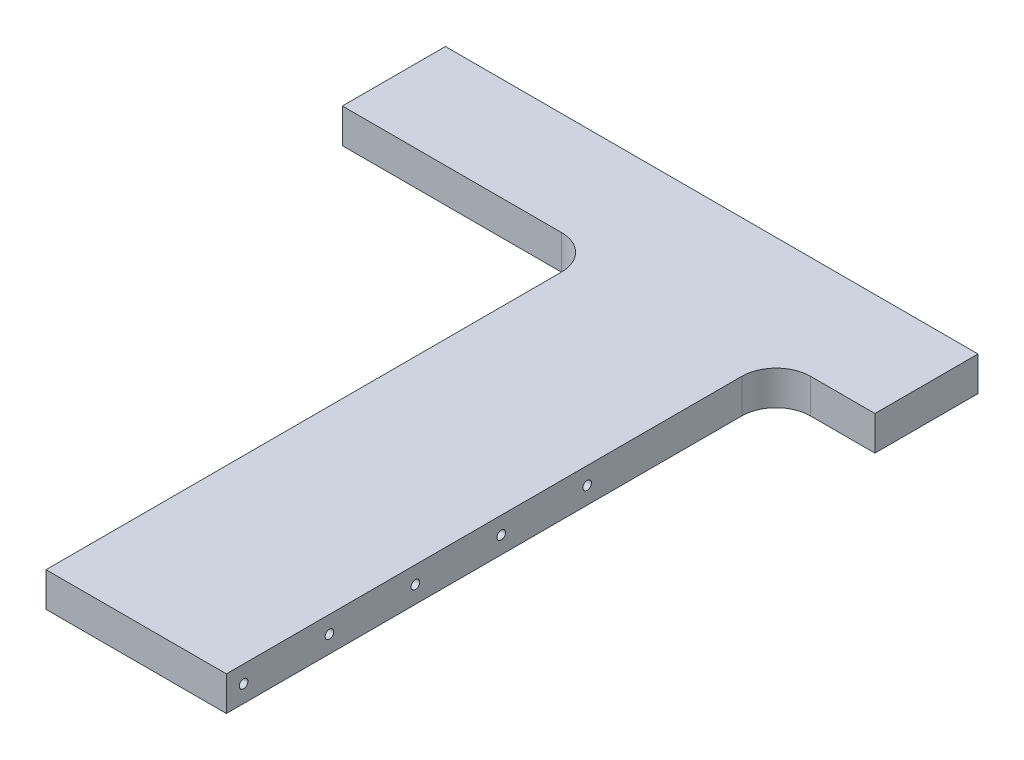
ISO-10303-21;
HEADER;
FILE_DESCRIPTION(('STEP AP214'),'2;1');
FILE_NAME('part.step','',(''),(''),'','','');
FILE_SCHEMA(('AUTOMOTIVE_DESIGN { 1 0 10303 214 1 1 1 1 }'));
ENDSEC;
DATA;
#1=APPLICATION_CONTEXT('core data for automotive mechanical design processes');
#2=APPLICATION_PROTOCOL_DEFINITION('international standard','automotive_design',2000,#1);
#3=PRODUCT_CONTEXT('',#1,'mechanical');
#4=PRODUCT('Part','Part','',(#3));
#5=PRODUCT_RELATED_PRODUCT_CATEGORY('part','',(#4));
#6=PRODUCT_DEFINITION_FORMATION('','',#4);
#7=PRODUCT_DEFINITION_CONTEXT('part definition',#1,'design');
#8=PRODUCT_DEFINITION('design','',#6,#7);
#9=PRODUCT_DEFINITION_SHAPE('','',#8);
#10=(LENGTH_UNIT() NAMED_UNIT(*) SI_UNIT(.MILLI.,.METRE.));
#11=(NAMED_UNIT(*) PLANE_ANGLE_UNIT() SI_UNIT($,.RADIAN.));
#12=(NAMED_UNIT(*) SI_UNIT($,.STERADIAN.) SOLID_ANGLE_UNIT());
#13=UNCERTAINTY_MEASURE_WITH_UNIT(LENGTH_MEASURE(1.E-05),#10,'distance_accuracy_value','');
#14=(GEOMETRIC_REPRESENTATION_CONTEXT(3) GLOBAL_UNCERTAINTY_ASSIGNED_CONTEXT((#13)) GLOBAL_UNIT_ASSIGNED_CONTEXT((#10,
#11,#12)) REPRESENTATION_CONTEXT('',''));
#15=CARTESIAN_POINT('',(0.,0.,0.));
#16=DIRECTION('',(0.,0.,1.));
#17=DIRECTION('',(1.,0.,0.));
#18=AXIS2_PLACEMENT_3D('',#15,#16,#17);
#19=CARTESIAN_POINT('',(-52.5,20.,0.));
#20=DIRECTION('',(1.,0.,0.));
#21=DIRECTION('',(0.,0.,-1.));
#22=AXIS2_PLACEMENT_3D('',#19,#20,#21);
#23=PLANE('',#22);
#24=CARTESIAN_POINT('',(-52.5,10.,-9.99999999999997));
#25=DIRECTION('',(-1.,0.,0.));
#26=DIRECTION('',(0.,0.,1.));
#27=AXIS2_PLACEMENT_3D('',#24,#25,#26);
#28=CIRCLE('',#27,2.5);
#29=CARTESIAN_POINT('',(-52.5,10.,-7.49999999999997));
#30=VERTEX_POINT('',#29);
#31=EDGE_CURVE('E198',#30,#30,#28,.T.);
#32=ORIENTED_EDGE('',*,*,#31,.F.);
#33=EDGE_LOOP('',(#32));
#34=FACE_BOUND('',#33,.T.);
#35=CARTESIAN_POINT('',(-52.5,10.,-60.));
#36=DIRECTION('',(-1.,0.,0.));
#37=DIRECTION('',(0.,0.,1.));
#38=AXIS2_PLACEMENT_3D('',#35,#36,#37);
#39=CIRCLE('',#38,2.5);
#40=CARTESIAN_POINT('',(-52.5,10.,-57.5));
#41=VERTEX_POINT('',#40);
#42=EDGE_CURVE('E204',#41,#41,#39,.T.);
#43=ORIENTED_EDGE('',*,*,#42,.F.);
#44=EDGE_LOOP('',(#43));
#45=FACE_BOUND('',#44,.T.);
#46=CARTESIAN_POINT('',(-52.5,10.,-110.));
#47=DIRECTION('',(-1.,0.,0.));
#48=DIRECTION('',(0.,0.,1.));
#49=AXIS2_PLACEMENT_3D('',#46,#47,#48);
#50=CIRCLE('',#49,2.5);
#51=CARTESIAN_POINT('',(-52.5,10.,-107.5));
#52=VERTEX_POINT('',#51);
#53=EDGE_CURVE('E210',#52,#52,#50,.T.);
#54=ORIENTED_EDGE('',*,*,#53,.F.);
#55=EDGE_LOOP('',(#54));
#56=FACE_BOUND('',#55,.T.);
#57=CARTESIAN_POINT('',(-52.5,10.,-160.));
#58=DIRECTION('',(-1.,0.,0.));
#59=DIRECTION('',(0.,0.,1.));
#60=AXIS2_PLACEMENT_3D('',#57,#58,#59);
#61=CIRCLE('',#60,2.5);
#62=CARTESIAN_POINT('',(-52.5,10.,-157.5));
#63=VERTEX_POINT('',#62);
#64=EDGE_CURVE('E216',#63,#63,#61,.T.);
#65=ORIENTED_EDGE('',*,*,#64,.F.);
#66=EDGE_LOOP('',(#65));
#67=FACE_BOUND('',#66,.T.);
#68=CARTESIAN_POINT('',(-52.5,10.,-210.));
#69=DIRECTION('',(-1.,0.,0.));
#70=DIRECTION('',(0.,0.,1.));
#71=AXIS2_PLACEMENT_3D('',#68,#69,#70);
#72=CIRCLE('',#71,2.5);
#73=CARTESIAN_POINT('',(-52.5,10.,-207.5));
#74=VERTEX_POINT('',#73);
#75=EDGE_CURVE('E222',#74,#74,#72,.T.);
#76=ORIENTED_EDGE('',*,*,#75,.F.);
#77=EDGE_LOOP('',(#76));
#78=FACE_BOUND('',#77,.T.);
#79=DIRECTION('',(0.,0.,1.));
#80=VECTOR('',#79,1.);
#81=CARTESIAN_POINT('',(-52.5,20.,0.));
#82=LINE('',#81,#80);
#83=CARTESIAN_POINT('',(-52.5,20.,-300.));
#84=VERTEX_POINT('',#83);
#85=CARTESIAN_POINT('',(-52.5,20.,0.));
#86=VERTEX_POINT('',#85);
#87=EDGE_CURVE('E259',#84,#86,#82,.T.);
#88=ORIENTED_EDGE('',*,*,#87,.F.);
#89=DIRECTION('',(0.,-1.,0.));
#90=VECTOR('',#89,1.);
#91=CARTESIAN_POINT('',(-52.5,0.,-300.));
#92=LINE('',#91,#90);
#93=CARTESIAN_POINT('',(-52.5,0.,-300.));
#94=VERTEX_POINT('',#93);
#95=EDGE_CURVE('E315',#84,#94,#92,.T.);
#96=ORIENTED_EDGE('',*,*,#95,.T.);
#97=DIRECTION('',(0.,0.,1.));
#98=VECTOR('',#97,1.);
#99=CARTESIAN_POINT('',(-52.5,0.,0.));
#100=LINE('',#99,#98);
#101=CARTESIAN_POINT('',(-52.5,0.,0.));
#102=VERTEX_POINT('',#101);
#103=EDGE_CURVE('E258',#94,#102,#100,.T.);
#104=ORIENTED_EDGE('',*,*,#103,.T.);
#105=DIRECTION('',(0.,-1.,0.));
#106=VECTOR('',#105,1.);
#107=CARTESIAN_POINT('',(-52.5,20.,0.));
#108=LINE('',#107,#106);
#109=EDGE_CURVE('E307',#86,#102,#108,.T.);
#110=ORIENTED_EDGE('',*,*,#109,.F.);
#111=EDGE_LOOP('',(#88,#96,#104,#110));
#112=FACE_BOUND('',#111,.T.);
#113=ADVANCED_FACE('F39',(#34,#45,#56,#67,#78,#112),#23,.F.);
#114=CARTESIAN_POINT('',(-52.5,20.,0.));
#115=DIRECTION('',(0.,0.,-1.));
#116=DIRECTION('',(-1.,0.,0.));
#117=AXIS2_PLACEMENT_3D('',#114,#115,#116);
#118=PLANE('',#117);
#119=DIRECTION('',(1.,0.,0.));
#120=VECTOR('',#119,1.);
#121=CARTESIAN_POINT('',(-52.5,0.,0.));
#122=LINE('',#121,#120);
#123=CARTESIAN_POINT('',(52.5,0.,0.));
#124=VERTEX_POINT('',#123);
#125=EDGE_CURVE('E279',#102,#124,#122,.T.);
#126=ORIENTED_EDGE('',*,*,#125,.T.);
#127=DIRECTION('',(0.,-1.,0.));
#128=VECTOR('',#127,1.);
#129=CARTESIAN_POINT('',(52.5,20.,0.));
#130=LINE('',#129,#128);
#131=CARTESIAN_POINT('',(52.5,20.,0.));
#132=VERTEX_POINT('',#131);
#133=EDGE_CURVE('E304',#132,#124,#130,.T.);
#134=ORIENTED_EDGE('',*,*,#133,.F.);
#135=DIRECTION('',(1.,0.,0.));
#136=VECTOR('',#135,1.);
#137=CARTESIAN_POINT('',(-52.5,20.,0.));
#138=LINE('',#137,#136);
#139=EDGE_CURVE('E261',#86,#132,#138,.T.);
#140=ORIENTED_EDGE('',*,*,#139,.F.);
#141=ORIENTED_EDGE('',*,*,#109,.T.);
#142=EDGE_LOOP('',(#126,#134,#140,#141));
#143=FACE_BOUND('',#142,.T.);
#144=ADVANCED_FACE('F345',(#143),#118,.F.);
#145=CARTESIAN_POINT('',(52.5,20.,0.));
#146=DIRECTION('',(-1.,0.,0.));
#147=DIRECTION('',(0.,0.,1.));
#148=AXIS2_PLACEMENT_3D('',#145,#146,#147);
#149=PLANE('',#148);
#150=CARTESIAN_POINT('',(52.5,10.,-9.99999999999997));
#151=DIRECTION('',(1.,0.,0.));
#152=DIRECTION('',(0.,0.,-1.));
#153=AXIS2_PLACEMENT_3D('',#150,#151,#152);
#154=CIRCLE('',#153,2.5);
#155=CARTESIAN_POINT('',(52.5,10.,-12.5));
#156=VERTEX_POINT('',#155);
#157=EDGE_CURVE('E228',#156,#156,#154,.T.);
#158=ORIENTED_EDGE('',*,*,#157,.F.);
#159=EDGE_LOOP('',(#158));
#160=FACE_BOUND('',#159,.T.);
#161=CARTESIAN_POINT('',(52.5,10.,-60.));
#162=DIRECTION('',(1.,0.,0.));
#163=DIRECTION('',(0.,0.,-1.));
#164=AXIS2_PLACEMENT_3D('',#161,#162,#163);
#165=CIRCLE('',#164,2.5);
#166=CARTESIAN_POINT('',(52.5,10.,-62.5));
#167=VERTEX_POINT('',#166);
#168=EDGE_CURVE('E234',#167,#167,#165,.T.);
#169=ORIENTED_EDGE('',*,*,#168,.F.);
#170=EDGE_LOOP('',(#169));
#171=FACE_BOUND('',#170,.T.);
#172=CARTESIAN_POINT('',(52.5,10.,-110.));
#173=DIRECTION('',(1.,0.,0.));
#174=DIRECTION('',(0.,0.,-1.));
#175=AXIS2_PLACEMENT_3D('',#172,#173,#174);
#176=CIRCLE('',#175,2.5);
#177=CARTESIAN_POINT('',(52.5,10.,-112.5));
#178=VERTEX_POINT('',#177);
#179=EDGE_CURVE('E240',#178,#178,#176,.T.);
#180=ORIENTED_EDGE('',*,*,#179,.F.);
#181=EDGE_LOOP('',(#180));
#182=FACE_BOUND('',#181,.T.);
#183=CARTESIAN_POINT('',(52.5,10.,-160.));
#184=DIRECTION('',(1.,0.,0.));
#185=DIRECTION('',(0.,0.,-1.));
#186=AXIS2_PLACEMENT_3D('',#183,#184,#185);
#187=CIRCLE('',#186,2.5);
#188=CARTESIAN_POINT('',(52.5,10.,-162.5));
#189=VERTEX_POINT('',#188);
#190=EDGE_CURVE('E246',#189,#189,#187,.T.);
#191=ORIENTED_EDGE('',*,*,#190,.F.);
#192=EDGE_LOOP('',(#191));
#193=FACE_BOUND('',#192,.T.);
#194=CARTESIAN_POINT('',(52.5,10.,-210.));
#195=DIRECTION('',(1.,0.,0.));
#196=DIRECTION('',(0.,0.,-1.));
#197=AXIS2_PLACEMENT_3D('',#194,#195,#196);
#198=CIRCLE('',#197,2.5);
#199=CARTESIAN_POINT('',(52.5,10.,-212.5));
#200=VERTEX_POINT('',#199);
#201=EDGE_CURVE('E252',#200,#200,#198,.T.);
#202=ORIENTED_EDGE('',*,*,#201,.F.);
#203=EDGE_LOOP('',(#202));
#204=FACE_BOUND('',#203,.T.);
#205=DIRECTION('',(0.,0.,-1.));
#206=VECTOR('',#205,1.);
#207=CARTESIAN_POINT('',(52.5,0.,0.));
#208=LINE('',#207,#206);
#209=CARTESIAN_POINT('',(52.4999999999999,0.,-300.));
#210=VERTEX_POINT('',#209);
#211=EDGE_CURVE('E281',#124,#210,#208,.T.);
#212=ORIENTED_EDGE('',*,*,#211,.T.);
#213=DIRECTION('',(0.,-1.,0.));
#214=VECTOR('',#213,1.);
#215=CARTESIAN_POINT('',(52.4999999999999,20.,-300.));
#216=LINE('',#215,#214);
#217=CARTESIAN_POINT('',(52.4999999999999,20.,-300.));
#218=VERTEX_POINT('',#217);
#219=EDGE_CURVE('E313',#210,#218,#216,.F.);
#220=ORIENTED_EDGE('',*,*,#219,.T.);
#221=DIRECTION('',(0.,0.,-1.));
#222=VECTOR('',#221,1.);
#223=CARTESIAN_POINT('',(52.5,20.,0.));
#224=LINE('',#223,#222);
#225=EDGE_CURVE('E264',#132,#218,#224,.T.);
#226=ORIENTED_EDGE('',*,*,#225,.F.);
#227=ORIENTED_EDGE('',*,*,#133,.T.);
#228=EDGE_LOOP('',(#212,#220,#226,#227));
#229=FACE_BOUND('',#228,.T.);
#230=ADVANCED_FACE('F341',(#160,#171,#182,#193,#204,#229),#149,.F.);
#231=CARTESIAN_POINT('',(110.,20.,-320.));
#232=DIRECTION('',(0.,0.,-1.));
#233=DIRECTION('',(-1.,0.,0.));
#234=AXIS2_PLACEMENT_3D('',#231,#232,#233);
#235=PLANE('',#234);
#236=DIRECTION('',(1.,0.,0.));
#237=VECTOR('',#236,1.);
#238=CARTESIAN_POINT('',(110.,20.,-320.));
#239=LINE('',#238,#237);
#240=CARTESIAN_POINT('',(72.4999999999999,20.,-320.));
#241=VERTEX_POINT('',#240);
#242=CARTESIAN_POINT('',(110.,20.,-320.));
#243=VERTEX_POINT('',#242);
#244=EDGE_CURVE('E267',#241,#243,#239,.T.);
#245=ORIENTED_EDGE('',*,*,#244,.F.);
#246=DIRECTION('',(0.,-1.,0.));
#247=VECTOR('',#246,1.);
#248=CARTESIAN_POINT('',(72.4999999999999,0.,-320.));
#249=LINE('',#248,#247);
#250=CARTESIAN_POINT('',(72.4999999999999,0.,-320.));
#251=VERTEX_POINT('',#250);
#252=EDGE_CURVE('E310',#241,#251,#249,.T.);
#253=ORIENTED_EDGE('',*,*,#252,.T.);
#254=DIRECTION('',(1.,0.,0.));
#255=VECTOR('',#254,1.);
#256=CARTESIAN_POINT('',(110.,0.,-320.));
#257=LINE('',#256,#255);
#258=CARTESIAN_POINT('',(110.,0.,-320.));
#259=VERTEX_POINT('',#258);
#260=EDGE_CURVE('E284',#251,#259,#257,.T.);
#261=ORIENTED_EDGE('',*,*,#260,.T.);
#262=DIRECTION('',(0.,-1.,0.));
#263=VECTOR('',#262,1.);
#264=CARTESIAN_POINT('',(110.,20.,-320.));
#265=LINE('',#264,#263);
#266=EDGE_CURVE('E301',#243,#259,#265,.T.);
#267=ORIENTED_EDGE('',*,*,#266,.F.);
#268=EDGE_LOOP('',(#245,#253,#261,#267));
#269=FACE_BOUND('',#268,.T.);
#270=ADVANCED_FACE('F332',(#269),#235,.F.);
#271=CARTESIAN_POINT('',(110.,20.,-380.));
#272=DIRECTION('',(-1.,0.,0.));
#273=DIRECTION('',(0.,0.,1.));
#274=AXIS2_PLACEMENT_3D('',#271,#272,#273);
#275=PLANE('',#274);
#276=DIRECTION('',(0.,0.,-1.));
#277=VECTOR('',#276,1.);
#278=CARTESIAN_POINT('',(110.,0.,-380.));
#279=LINE('',#278,#277);
#280=CARTESIAN_POINT('',(110.,0.,-380.));
#281=VERTEX_POINT('',#280);
#282=EDGE_CURVE('E286',#259,#281,#279,.T.);
#283=ORIENTED_EDGE('',*,*,#282,.T.);
#284=DIRECTION('',(0.,-1.,0.));
#285=VECTOR('',#284,1.);
#286=CARTESIAN_POINT('',(110.,20.,-380.));
#287=LINE('',#286,#285);
#288=CARTESIAN_POINT('',(110.,20.,-380.));
#289=VERTEX_POINT('',#288);
#290=EDGE_CURVE('E298',#289,#281,#287,.T.);
#291=ORIENTED_EDGE('',*,*,#290,.F.);
#292=DIRECTION('',(0.,0.,-1.));
#293=VECTOR('',#292,1.);
#294=CARTESIAN_POINT('',(110.,20.,-380.));
#295=LINE('',#294,#293);
#296=EDGE_CURVE('E269',#243,#289,#295,.T.);
#297=ORIENTED_EDGE('',*,*,#296,.F.);
#298=ORIENTED_EDGE('',*,*,#266,.T.);
#299=EDGE_LOOP('',(#283,#291,#297,#298));
#300=FACE_BOUND('',#299,.T.);
#301=ADVANCED_FACE('F365',(#300),#275,.F.);
#302=CARTESIAN_POINT('',(-200.,20.,-380.));
#303=DIRECTION('',(0.,0.,1.));
#304=DIRECTION('',(1.,0.,0.));
#305=AXIS2_PLACEMENT_3D('',#302,#303,#304);
#306=PLANE('',#305);
#307=CARTESIAN_POINT('',(29.9999999999999,10.,-380.));
#308=DIRECTION('',(0.,0.,-1.));
#309=DIRECTION('',(-1.,0.,0.));
#310=AXIS2_PLACEMENT_3D('',#307,#308,#309);
#311=CIRCLE('',#310,3.);
#312=CARTESIAN_POINT('',(26.9999999999999,10.,-380.));
#313=VERTEX_POINT('',#312);
#314=EDGE_CURVE('E170',#313,#313,#311,.T.);
#315=ORIENTED_EDGE('',*,*,#314,.F.);
#316=EDGE_LOOP('',(#315));
#317=FACE_BOUND('',#316,.T.);
#318=CARTESIAN_POINT('',(-120.,10.,-380.));
#319=DIRECTION('',(0.,0.,-1.));
#320=DIRECTION('',(-1.,0.,0.));
#321=AXIS2_PLACEMENT_3D('',#318,#319,#320);
#322=CIRCLE('',#321,3.);
#323=CARTESIAN_POINT('',(-123.,10.,-380.));
#324=VERTEX_POINT('',#323);
#325=EDGE_CURVE('E169',#324,#324,#322,.T.);
#326=ORIENTED_EDGE('',*,*,#325,.F.);
#327=EDGE_LOOP('',(#326));
#328=FACE_BOUND('',#327,.T.);
#329=CARTESIAN_POINT('',(89.9999999999999,10.,-380.));
#330=DIRECTION('',(0.,0.,-1.));
#331=DIRECTION('',(-1.,0.,0.));
#332=AXIS2_PLACEMENT_3D('',#329,#330,#331);
#333=CIRCLE('',#332,2.49999999999999);
#334=CARTESIAN_POINT('',(87.4999999999999,10.,-380.));
#335=VERTEX_POINT('',#334);
#336=EDGE_CURVE('E180',#335,#335,#333,.T.);
#337=ORIENTED_EDGE('',*,*,#336,.F.);
#338=EDGE_LOOP('',(#337));
#339=FACE_BOUND('',#338,.T.);
#340=CARTESIAN_POINT('',(-180.,10.,-380.));
#341=DIRECTION('',(0.,0.,-1.));
#342=DIRECTION('',(-1.,0.,0.));
#343=AXIS2_PLACEMENT_3D('',#340,#341,#342);
#344=CIRCLE('',#343,2.5);
#345=CARTESIAN_POINT('',(-182.5,10.,-380.));
#346=VERTEX_POINT('',#345);
#347=EDGE_CURVE('E186',#346,#346,#344,.T.);
#348=ORIENTED_EDGE('',*,*,#347,.F.);
#349=EDGE_LOOP('',(#348));
#350=FACE_BOUND('',#349,.T.);
#351=CARTESIAN_POINT('',(0.,10.,-380.));
#352=DIRECTION('',(0.,0.,-1.));
#353=DIRECTION('',(-1.,0.,0.));
#354=AXIS2_PLACEMENT_3D('',#351,#352,#353);
#355=CIRCLE('',#354,2.49999999999999);
#356=CARTESIAN_POINT('',(-2.49999999999999,10.,-380.));
#357=VERTEX_POINT('',#356);
#358=EDGE_CURVE('E192',#357,#357,#355,.T.);
#359=ORIENTED_EDGE('',*,*,#358,.F.);
#360=EDGE_LOOP('',(#359));
#361=FACE_BOUND('',#360,.T.);
#362=DIRECTION('',(-1.,0.,0.));
#363=VECTOR('',#362,1.);
#364=CARTESIAN_POINT('',(-200.,0.,-380.));
#365=LINE('',#364,#363);
#366=CARTESIAN_POINT('',(-200.,0.,-380.));
#367=VERTEX_POINT('',#366);
#368=EDGE_CURVE('E288',#281,#367,#365,.T.);
#369=ORIENTED_EDGE('',*,*,#368,.T.);
#370=DIRECTION('',(0.,-1.,0.));
#371=VECTOR('',#370,1.);
#372=CARTESIAN_POINT('',(-200.,20.,-380.));
#373=LINE('',#372,#371);
#374=CARTESIAN_POINT('',(-200.,20.,-380.));
#375=VERTEX_POINT('',#374);
#376=EDGE_CURVE('E295',#375,#367,#373,.T.);
#377=ORIENTED_EDGE('',*,*,#376,.F.);
#378=DIRECTION('',(-1.,0.,0.));
#379=VECTOR('',#378,1.);
#380=CARTESIAN_POINT('',(-200.,20.,-380.));
#381=LINE('',#380,#379);
#382=EDGE_CURVE('E271',#289,#375,#381,.T.);
#383=ORIENTED_EDGE('',*,*,#382,.F.);
#384=ORIENTED_EDGE('',*,*,#290,.T.);
#385=EDGE_LOOP('',(#369,#377,#383,#384));
#386=FACE_BOUND('',#385,.T.);
#387=ADVANCED_FACE('F362',(#317,#328,#339,#350,#361,#386),#306,.F.);
#388=CARTESIAN_POINT('',(-200.,20.,-380.));
#389=DIRECTION('',(1.,0.,0.));
#390=DIRECTION('',(0.,0.,-1.));
#391=AXIS2_PLACEMENT_3D('',#388,#389,#390);
#392=PLANE('',#391);
#393=DIRECTION('',(0.,0.,1.));
#394=VECTOR('',#393,1.);
#395=CARTESIAN_POINT('',(-200.,0.,-380.));
#396=LINE('',#395,#394);
#397=CARTESIAN_POINT('',(-200.,0.,-320.));
#398=VERTEX_POINT('',#397);
#399=EDGE_CURVE('E290',#367,#398,#396,.T.);
#400=ORIENTED_EDGE('',*,*,#399,.T.);
#401=DIRECTION('',(0.,-1.,0.));
#402=VECTOR('',#401,1.);
#403=CARTESIAN_POINT('',(-200.,20.,-320.));
#404=LINE('',#403,#402);
#405=CARTESIAN_POINT('',(-200.,20.,-320.));
#406=VERTEX_POINT('',#405);
#407=EDGE_CURVE('E277',#406,#398,#404,.T.);
#408=ORIENTED_EDGE('',*,*,#407,.F.);
#409=DIRECTION('',(0.,0.,1.));
#410=VECTOR('',#409,1.);
#411=CARTESIAN_POINT('',(-200.,20.,-380.));
#412=LINE('',#411,#410);
#413=EDGE_CURVE('E273',#375,#406,#412,.T.);
#414=ORIENTED_EDGE('',*,*,#413,.F.);
#415=ORIENTED_EDGE('',*,*,#376,.T.);
#416=EDGE_LOOP('',(#400,#408,#414,#415));
#417=FACE_BOUND('',#416,.T.);
#418=ADVANCED_FACE('F358',(#417),#392,.F.);
#419=CARTESIAN_POINT('',(-200.,20.,-320.));
#420=DIRECTION('',(0.,0.,-1.));
#421=DIRECTION('',(-1.,0.,0.));
#422=AXIS2_PLACEMENT_3D('',#419,#420,#421);
#423=PLANE('',#422);
#424=DIRECTION('',(1.,0.,0.));
#425=VECTOR('',#424,1.);
#426=CARTESIAN_POINT('',(-200.,0.,-320.));
#427=LINE('',#426,#425);
#428=CARTESIAN_POINT('',(-72.5000000000001,0.,-320.));
#429=VERTEX_POINT('',#428);
#430=EDGE_CURVE('E262',#398,#429,#427,.T.);
#431=ORIENTED_EDGE('',*,*,#430,.T.);
#432=DIRECTION('',(0.,-1.,0.));
#433=VECTOR('',#432,1.);
#434=CARTESIAN_POINT('',(-72.5,20.,-320.));
#435=LINE('',#434,#433);
#436=CARTESIAN_POINT('',(-72.5000000000001,20.,-320.));
#437=VERTEX_POINT('',#436);
#438=EDGE_CURVE('E54',#429,#437,#435,.F.);
#439=ORIENTED_EDGE('',*,*,#438,.T.);
#440=DIRECTION('',(1.,0.,0.));
#441=VECTOR('',#440,1.);
#442=CARTESIAN_POINT('',(-200.,20.,-320.));
#443=LINE('',#442,#441);
#444=EDGE_CURVE('E275',#406,#437,#443,.T.);
#445=ORIENTED_EDGE('',*,*,#444,.F.);
#446=ORIENTED_EDGE('',*,*,#407,.T.);
#447=EDGE_LOOP('',(#431,#439,#445,#446));
#448=FACE_BOUND('',#447,.T.);
#449=ADVANCED_FACE('F354',(#448),#423,.F.);
#450=CARTESIAN_POINT('',(0.,20.,0.));
#451=DIRECTION('',(0.,-1.,0.));
#452=DIRECTION('',(0.,0.,-1.));
#453=AXIS2_PLACEMENT_3D('',#450,#451,#452);
#454=PLANE('',#453);
#455=ORIENTED_EDGE('',*,*,#444,.T.);
#456=CARTESIAN_POINT('',(-72.5,20.,-300.));
#457=DIRECTION('',(0.,-1.,0.));
#458=DIRECTION('',(0.,0.,-1.));
#459=AXIS2_PLACEMENT_3D('',#456,#457,#458);
#460=CIRCLE('',#459,20.);
#461=EDGE_CURVE('E11',#437,#84,#460,.T.);
#462=ORIENTED_EDGE('',*,*,#461,.T.);
#463=ORIENTED_EDGE('',*,*,#87,.T.);
#464=ORIENTED_EDGE('',*,*,#139,.T.);
#465=ORIENTED_EDGE('',*,*,#225,.T.);
#466=CARTESIAN_POINT('',(72.4999999999999,20.,-300.));
#467=DIRECTION('',(0.,-1.,0.));
#468=DIRECTION('',(0.,0.,-1.));
#469=AXIS2_PLACEMENT_3D('',#466,#467,#468);
#470=CIRCLE('',#469,20.);
#471=EDGE_CURVE('E321',#218,#241,#470,.T.);
#472=ORIENTED_EDGE('',*,*,#471,.T.);
#473=ORIENTED_EDGE('',*,*,#244,.T.);
#474=ORIENTED_EDGE('',*,*,#296,.T.);
#475=ORIENTED_EDGE('',*,*,#382,.T.);
#476=ORIENTED_EDGE('',*,*,#413,.T.);
#477=EDGE_LOOP('',(#455,#462,#463,#464,#465,#472,#473,#474,#475,#476));
#478=FACE_BOUND('',#477,.T.);
#479=ADVANCED_FACE('F325',(#478),#454,.F.);
#480=CARTESIAN_POINT('',(0.,0.,0.));
#481=DIRECTION('',(0.,-1.,0.));
#482=DIRECTION('',(0.,0.,-1.));
#483=AXIS2_PLACEMENT_3D('',#480,#481,#482);
#484=PLANE('',#483);
#485=ORIENTED_EDGE('',*,*,#103,.F.);
#486=CARTESIAN_POINT('',(-72.5,0.,-300.));
#487=DIRECTION('',(0.,-1.,0.));
#488=DIRECTION('',(0.,0.,-1.));
#489=AXIS2_PLACEMENT_3D('',#486,#487,#488);
#490=CIRCLE('',#489,20.);
#491=EDGE_CURVE('E47',#94,#429,#490,.F.);
#492=ORIENTED_EDGE('',*,*,#491,.T.);
#493=ORIENTED_EDGE('',*,*,#430,.F.);
#494=ORIENTED_EDGE('',*,*,#399,.F.);
#495=ORIENTED_EDGE('',*,*,#368,.F.);
#496=ORIENTED_EDGE('',*,*,#282,.F.);
#497=ORIENTED_EDGE('',*,*,#260,.F.);
#498=CARTESIAN_POINT('',(72.4999999999999,0.,-300.));
#499=DIRECTION('',(0.,-1.,0.));
#500=DIRECTION('',(0.,0.,-1.));
#501=AXIS2_PLACEMENT_3D('',#498,#499,#500);
#502=CIRCLE('',#501,20.);
#503=EDGE_CURVE('E319',#251,#210,#502,.F.);
#504=ORIENTED_EDGE('',*,*,#503,.T.);
#505=ORIENTED_EDGE('',*,*,#211,.F.);
#506=ORIENTED_EDGE('',*,*,#125,.F.);
#507=EDGE_LOOP('',(#485,#492,#493,#494,#495,#496,#497,#504,#505,#506));
#508=FACE_BOUND('',#507,.T.);
#509=ADVANCED_FACE('F337',(#508),#484,.T.);
#510=CARTESIAN_POINT('',(35.5,10.,-210.));
#511=DIRECTION('',(1.,0.,0.));
#512=DIRECTION('',(0.,0.,-1.));
#513=AXIS2_PLACEMENT_3D('',#510,#511,#512);
#514=CONICAL_SURFACE('',#513,2.5,1.02974425867665);
#515=CARTESIAN_POINT('',(33.9978484524311,10.,-210.));
#516=VERTEX_POINT('',#515);
#517=VERTEX_LOOP('',#516);
#518=FACE_BOUND('',#517,.T.);
#519=CARTESIAN_POINT('',(35.5,10.,-210.));
#520=DIRECTION('',(1.,0.,0.));
#521=DIRECTION('',(0.,0.,-1.));
#522=AXIS2_PLACEMENT_3D('',#519,#520,#521);
#523=CIRCLE('',#522,2.5);
#524=CARTESIAN_POINT('',(35.5,10.,-212.5));
#525=VERTEX_POINT('',#524);
#526=EDGE_CURVE('E255',#525,#525,#523,.T.);
#527=ORIENTED_EDGE('',*,*,#526,.T.);
#528=EDGE_LOOP('',(#527));
#529=FACE_BOUND('',#528,.T.);
#530=ADVANCED_FACE('F496',(#518,#529),#514,.F.);
#531=CARTESIAN_POINT('',(52.5,10.,-210.));
#532=DIRECTION('',(1.,0.,0.));
#533=DIRECTION('',(0.,0.,-1.));
#534=AXIS2_PLACEMENT_3D('',#531,#532,#533);
#535=CYLINDRICAL_SURFACE('',#534,2.5);
#536=ORIENTED_EDGE('',*,*,#526,.F.);
#537=EDGE_LOOP('',(#536));
#538=FACE_BOUND('',#537,.T.);
#539=ORIENTED_EDGE('',*,*,#201,.T.);
#540=EDGE_LOOP('',(#539));
#541=FACE_BOUND('',#540,.T.);
#542=ADVANCED_FACE('F492',(#538,#541),#535,.F.);
#543=CARTESIAN_POINT('',(35.5,10.,-160.));
#544=DIRECTION('',(1.,0.,0.));
#545=DIRECTION('',(0.,0.,-1.));
#546=AXIS2_PLACEMENT_3D('',#543,#544,#545);
#547=CONICAL_SURFACE('',#546,2.5,1.02974425867665);
#548=CARTESIAN_POINT('',(33.9978484524311,10.,-160.));
#549=VERTEX_POINT('',#548);
#550=VERTEX_LOOP('',#549);
#551=FACE_BOUND('',#550,.T.);
#552=CARTESIAN_POINT('',(35.5,10.,-160.));
#553=DIRECTION('',(1.,0.,0.));
#554=DIRECTION('',(0.,0.,-1.));
#555=AXIS2_PLACEMENT_3D('',#552,#553,#554);
#556=CIRCLE('',#555,2.5);
#557=CARTESIAN_POINT('',(35.5,10.,-162.5));
#558=VERTEX_POINT('',#557);
#559=EDGE_CURVE('E249',#558,#558,#556,.T.);
#560=ORIENTED_EDGE('',*,*,#559,.T.);
#561=EDGE_LOOP('',(#560));
#562=FACE_BOUND('',#561,.T.);
#563=ADVANCED_FACE('F488',(#551,#562),#547,.F.);
#564=CARTESIAN_POINT('',(52.5,10.,-160.));
#565=DIRECTION('',(1.,0.,0.));
#566=DIRECTION('',(0.,0.,-1.));
#567=AXIS2_PLACEMENT_3D('',#564,#565,#566);
#568=CYLINDRICAL_SURFACE('',#567,2.5);
#569=ORIENTED_EDGE('',*,*,#559,.F.);
#570=EDGE_LOOP('',(#569));
#571=FACE_BOUND('',#570,.T.);
#572=ORIENTED_EDGE('',*,*,#190,.T.);
#573=EDGE_LOOP('',(#572));
#574=FACE_BOUND('',#573,.T.);
#575=ADVANCED_FACE('F484',(#571,#574),#568,.F.);
#576=CARTESIAN_POINT('',(35.5,10.,-110.));
#577=DIRECTION('',(1.,0.,0.));
#578=DIRECTION('',(0.,0.,-1.));
#579=AXIS2_PLACEMENT_3D('',#576,#577,#578);
#580=CONICAL_SURFACE('',#579,2.5,1.02974425867665);
#581=CARTESIAN_POINT('',(33.9978484524311,10.,-110.));
#582=VERTEX_POINT('',#581);
#583=VERTEX_LOOP('',#582);
#584=FACE_BOUND('',#583,.T.);
#585=CARTESIAN_POINT('',(35.5,10.,-110.));
#586=DIRECTION('',(1.,0.,0.));
#587=DIRECTION('',(0.,0.,-1.));
#588=AXIS2_PLACEMENT_3D('',#585,#586,#587);
#589=CIRCLE('',#588,2.5);
#590=CARTESIAN_POINT('',(35.5,10.,-112.5));
#591=VERTEX_POINT('',#590);
#592=EDGE_CURVE('E243',#591,#591,#589,.T.);
#593=ORIENTED_EDGE('',*,*,#592,.T.);
#594=EDGE_LOOP('',(#593));
#595=FACE_BOUND('',#594,.T.);
#596=ADVANCED_FACE('F480',(#584,#595),#580,.F.);
#597=CARTESIAN_POINT('',(52.5,10.,-110.));
#598=DIRECTION('',(1.,0.,0.));
#599=DIRECTION('',(0.,0.,-1.));
#600=AXIS2_PLACEMENT_3D('',#597,#598,#599);
#601=CYLINDRICAL_SURFACE('',#600,2.5);
#602=ORIENTED_EDGE('',*,*,#592,.F.);
#603=EDGE_LOOP('',(#602));
#604=FACE_BOUND('',#603,.T.);
#605=ORIENTED_EDGE('',*,*,#179,.T.);
#606=EDGE_LOOP('',(#605));
#607=FACE_BOUND('',#606,.T.);
#608=ADVANCED_FACE('F476',(#604,#607),#601,.F.);
#609=CARTESIAN_POINT('',(35.5,10.,-60.));
#610=DIRECTION('',(1.,0.,0.));
#611=DIRECTION('',(0.,0.,-1.));
#612=AXIS2_PLACEMENT_3D('',#609,#610,#611);
#613=CONICAL_SURFACE('',#612,2.5,1.02974425867665);
#614=CARTESIAN_POINT('',(33.9978484524311,10.,-60.));
#615=VERTEX_POINT('',#614);
#616=VERTEX_LOOP('',#615);
#617=FACE_BOUND('',#616,.T.);
#618=CARTESIAN_POINT('',(35.5,10.,-60.));
#619=DIRECTION('',(1.,0.,0.));
#620=DIRECTION('',(0.,0.,-1.));
#621=AXIS2_PLACEMENT_3D('',#618,#619,#620);
#622=CIRCLE('',#621,2.5);
#623=CARTESIAN_POINT('',(35.5,10.,-62.5));
#624=VERTEX_POINT('',#623);
#625=EDGE_CURVE('E237',#624,#624,#622,.T.);
#626=ORIENTED_EDGE('',*,*,#625,.T.);
#627=EDGE_LOOP('',(#626));
#628=FACE_BOUND('',#627,.T.);
#629=ADVANCED_FACE('F472',(#617,#628),#613,.F.);
#630=CARTESIAN_POINT('',(52.5,10.,-60.));
#631=DIRECTION('',(1.,0.,0.));
#632=DIRECTION('',(0.,0.,-1.));
#633=AXIS2_PLACEMENT_3D('',#630,#631,#632);
#634=CYLINDRICAL_SURFACE('',#633,2.5);
#635=ORIENTED_EDGE('',*,*,#625,.F.);
#636=EDGE_LOOP('',(#635));
#637=FACE_BOUND('',#636,.T.);
#638=ORIENTED_EDGE('',*,*,#168,.T.);
#639=EDGE_LOOP('',(#638));
#640=FACE_BOUND('',#639,.T.);
#641=ADVANCED_FACE('F468',(#637,#640),#634,.F.);
#642=CARTESIAN_POINT('',(35.5,10.,-9.99999999999997));
#643=DIRECTION('',(1.,0.,0.));
#644=DIRECTION('',(0.,0.,-1.));
#645=AXIS2_PLACEMENT_3D('',#642,#643,#644);
#646=CONICAL_SURFACE('',#645,2.5,1.02974425867665);
#647=CARTESIAN_POINT('',(33.9978484524311,10.,-9.99999999999997));
#648=VERTEX_POINT('',#647);
#649=VERTEX_LOOP('',#648);
#650=FACE_BOUND('',#649,.T.);
#651=CARTESIAN_POINT('',(35.5,10.,-9.99999999999997));
#652=DIRECTION('',(1.,0.,0.));
#653=DIRECTION('',(0.,0.,-1.));
#654=AXIS2_PLACEMENT_3D('',#651,#652,#653);
#655=CIRCLE('',#654,2.5);
#656=CARTESIAN_POINT('',(35.5,10.,-12.5));
#657=VERTEX_POINT('',#656);
#658=EDGE_CURVE('E231',#657,#657,#655,.T.);
#659=ORIENTED_EDGE('',*,*,#658,.T.);
#660=EDGE_LOOP('',(#659));
#661=FACE_BOUND('',#660,.T.);
#662=ADVANCED_FACE('F464',(#650,#661),#646,.F.);
#663=CARTESIAN_POINT('',(52.5,10.,-9.99999999999997));
#664=DIRECTION('',(1.,0.,0.));
#665=DIRECTION('',(0.,0.,-1.));
#666=AXIS2_PLACEMENT_3D('',#663,#664,#665);
#667=CYLINDRICAL_SURFACE('',#666,2.5);
#668=ORIENTED_EDGE('',*,*,#658,.F.);
#669=EDGE_LOOP('',(#668));
#670=FACE_BOUND('',#669,.T.);
#671=ORIENTED_EDGE('',*,*,#157,.T.);
#672=EDGE_LOOP('',(#671));
#673=FACE_BOUND('',#672,.T.);
#674=ADVANCED_FACE('F460',(#670,#673),#667,.F.);
#675=CARTESIAN_POINT('',(-35.5,10.,-210.));
#676=DIRECTION('',(-1.,0.,0.));
#677=DIRECTION('',(0.,0.,1.));
#678=AXIS2_PLACEMENT_3D('',#675,#676,#677);
#679=CONICAL_SURFACE('',#678,2.5,1.02974425867665);
#680=CARTESIAN_POINT('',(-33.9978484524311,10.,-210.));
#681=VERTEX_POINT('',#680);
#682=VERTEX_LOOP('',#681);
#683=FACE_BOUND('',#682,.T.);
#684=CARTESIAN_POINT('',(-35.5,10.,-210.));
#685=DIRECTION('',(-1.,0.,0.));
#686=DIRECTION('',(0.,0.,1.));
#687=AXIS2_PLACEMENT_3D('',#684,#685,#686);
#688=CIRCLE('',#687,2.5);
#689=CARTESIAN_POINT('',(-35.5,10.,-207.5));
#690=VERTEX_POINT('',#689);
#691=EDGE_CURVE('E225',#690,#690,#688,.T.);
#692=ORIENTED_EDGE('',*,*,#691,.T.);
#693=EDGE_LOOP('',(#692));
#694=FACE_BOUND('',#693,.T.);
#695=ADVANCED_FACE('F456',(#683,#694),#679,.F.);
#696=CARTESIAN_POINT('',(-52.5,10.,-210.));
#697=DIRECTION('',(-1.,0.,0.));
#698=DIRECTION('',(0.,0.,1.));
#699=AXIS2_PLACEMENT_3D('',#696,#697,#698);
#700=CYLINDRICAL_SURFACE('',#699,2.5);
#701=ORIENTED_EDGE('',*,*,#691,.F.);
#702=EDGE_LOOP('',(#701));
#703=FACE_BOUND('',#702,.T.);
#704=ORIENTED_EDGE('',*,*,#75,.T.);
#705=EDGE_LOOP('',(#704));
#706=FACE_BOUND('',#705,.T.);
#707=ADVANCED_FACE('F452',(#703,#706),#700,.F.);
#708=CARTESIAN_POINT('',(-35.5,10.,-160.));
#709=DIRECTION('',(-1.,0.,0.));
#710=DIRECTION('',(0.,0.,1.));
#711=AXIS2_PLACEMENT_3D('',#708,#709,#710);
#712=CONICAL_SURFACE('',#711,2.5,1.02974425867665);
#713=CARTESIAN_POINT('',(-33.9978484524311,10.,-160.));
#714=VERTEX_POINT('',#713);
#715=VERTEX_LOOP('',#714);
#716=FACE_BOUND('',#715,.T.);
#717=CARTESIAN_POINT('',(-35.5,10.,-160.));
#718=DIRECTION('',(-1.,0.,0.));
#719=DIRECTION('',(0.,0.,1.));
#720=AXIS2_PLACEMENT_3D('',#717,#718,#719);
#721=CIRCLE('',#720,2.5);
#722=CARTESIAN_POINT('',(-35.5,10.,-157.5));
#723=VERTEX_POINT('',#722);
#724=EDGE_CURVE('E219',#723,#723,#721,.T.);
#725=ORIENTED_EDGE('',*,*,#724,.T.);
#726=EDGE_LOOP('',(#725));
#727=FACE_BOUND('',#726,.T.);
#728=ADVANCED_FACE('F448',(#716,#727),#712,.F.);
#729=CARTESIAN_POINT('',(-52.5,10.,-160.));
#730=DIRECTION('',(-1.,0.,0.));
#731=DIRECTION('',(0.,0.,1.));
#732=AXIS2_PLACEMENT_3D('',#729,#730,#731);
#733=CYLINDRICAL_SURFACE('',#732,2.5);
#734=ORIENTED_EDGE('',*,*,#724,.F.);
#735=EDGE_LOOP('',(#734));
#736=FACE_BOUND('',#735,.T.);
#737=ORIENTED_EDGE('',*,*,#64,.T.);
#738=EDGE_LOOP('',(#737));
#739=FACE_BOUND('',#738,.T.);
#740=ADVANCED_FACE('F444',(#736,#739),#733,.F.);
#741=CARTESIAN_POINT('',(-35.5,10.,-110.));
#742=DIRECTION('',(-1.,0.,0.));
#743=DIRECTION('',(0.,0.,1.));
#744=AXIS2_PLACEMENT_3D('',#741,#742,#743);
#745=CONICAL_SURFACE('',#744,2.5,1.02974425867665);
#746=CARTESIAN_POINT('',(-33.9978484524311,10.,-110.));
#747=VERTEX_POINT('',#746);
#748=VERTEX_LOOP('',#747);
#749=FACE_BOUND('',#748,.T.);
#750=CARTESIAN_POINT('',(-35.5,10.,-110.));
#751=DIRECTION('',(-1.,0.,0.));
#752=DIRECTION('',(0.,0.,1.));
#753=AXIS2_PLACEMENT_3D('',#750,#751,#752);
#754=CIRCLE('',#753,2.5);
#755=CARTESIAN_POINT('',(-35.5,10.,-107.5));
#756=VERTEX_POINT('',#755);
#757=EDGE_CURVE('E213',#756,#756,#754,.T.);
#758=ORIENTED_EDGE('',*,*,#757,.T.);
#759=EDGE_LOOP('',(#758));
#760=FACE_BOUND('',#759,.T.);
#761=ADVANCED_FACE('F440',(#749,#760),#745,.F.);
#762=CARTESIAN_POINT('',(-52.5,10.,-110.));
#763=DIRECTION('',(-1.,0.,0.));
#764=DIRECTION('',(0.,0.,1.));
#765=AXIS2_PLACEMENT_3D('',#762,#763,#764);
#766=CYLINDRICAL_SURFACE('',#765,2.5);
#767=ORIENTED_EDGE('',*,*,#757,.F.);
#768=EDGE_LOOP('',(#767));
#769=FACE_BOUND('',#768,.T.);
#770=ORIENTED_EDGE('',*,*,#53,.T.);
#771=EDGE_LOOP('',(#770));
#772=FACE_BOUND('',#771,.T.);
#773=ADVANCED_FACE('F436',(#769,#772),#766,.F.);
#774=CARTESIAN_POINT('',(-35.5,10.,-60.));
#775=DIRECTION('',(-1.,0.,0.));
#776=DIRECTION('',(0.,0.,1.));
#777=AXIS2_PLACEMENT_3D('',#774,#775,#776);
#778=CONICAL_SURFACE('',#777,2.5,1.02974425867665);
#779=CARTESIAN_POINT('',(-33.9978484524311,10.,-60.));
#780=VERTEX_POINT('',#779);
#781=VERTEX_LOOP('',#780);
#782=FACE_BOUND('',#781,.T.);
#783=CARTESIAN_POINT('',(-35.5,10.,-60.));
#784=DIRECTION('',(-1.,0.,0.));
#785=DIRECTION('',(0.,0.,1.));
#786=AXIS2_PLACEMENT_3D('',#783,#784,#785);
#787=CIRCLE('',#786,2.5);
#788=CARTESIAN_POINT('',(-35.5,10.,-57.5));
#789=VERTEX_POINT('',#788);
#790=EDGE_CURVE('E207',#789,#789,#787,.T.);
#791=ORIENTED_EDGE('',*,*,#790,.T.);
#792=EDGE_LOOP('',(#791));
#793=FACE_BOUND('',#792,.T.);
#794=ADVANCED_FACE('F432',(#782,#793),#778,.F.);
#795=CARTESIAN_POINT('',(-52.5,10.,-60.));
#796=DIRECTION('',(-1.,0.,0.));
#797=DIRECTION('',(0.,0.,1.));
#798=AXIS2_PLACEMENT_3D('',#795,#796,#797);
#799=CYLINDRICAL_SURFACE('',#798,2.5);
#800=ORIENTED_EDGE('',*,*,#790,.F.);
#801=EDGE_LOOP('',(#800));
#802=FACE_BOUND('',#801,.T.);
#803=ORIENTED_EDGE('',*,*,#42,.T.);
#804=EDGE_LOOP('',(#803));
#805=FACE_BOUND('',#804,.T.);
#806=ADVANCED_FACE('F428',(#802,#805),#799,.F.);
#807=CARTESIAN_POINT('',(-35.5,10.,-9.99999999999997));
#808=DIRECTION('',(-1.,0.,0.));
#809=DIRECTION('',(0.,0.,1.));
#810=AXIS2_PLACEMENT_3D('',#807,#808,#809);
#811=CONICAL_SURFACE('',#810,2.5,1.02974425867665);
#812=CARTESIAN_POINT('',(-33.9978484524311,10.,-9.99999999999997));
#813=VERTEX_POINT('',#812);
#814=VERTEX_LOOP('',#813);
#815=FACE_BOUND('',#814,.T.);
#816=CARTESIAN_POINT('',(-35.5,10.,-9.99999999999997));
#817=DIRECTION('',(-1.,0.,0.));
#818=DIRECTION('',(0.,0.,1.));
#819=AXIS2_PLACEMENT_3D('',#816,#817,#818);
#820=CIRCLE('',#819,2.5);
#821=CARTESIAN_POINT('',(-35.5,10.,-7.49999999999998));
#822=VERTEX_POINT('',#821);
#823=EDGE_CURVE('E201',#822,#822,#820,.T.);
#824=ORIENTED_EDGE('',*,*,#823,.T.);
#825=EDGE_LOOP('',(#824));
#826=FACE_BOUND('',#825,.T.);
#827=ADVANCED_FACE('F424',(#815,#826),#811,.F.);
#828=CARTESIAN_POINT('',(-52.5,10.,-9.99999999999997));
#829=DIRECTION('',(-1.,0.,0.));
#830=DIRECTION('',(0.,0.,1.));
#831=AXIS2_PLACEMENT_3D('',#828,#829,#830);
#832=CYLINDRICAL_SURFACE('',#831,2.5);
#833=ORIENTED_EDGE('',*,*,#823,.F.);
#834=EDGE_LOOP('',(#833));
#835=FACE_BOUND('',#834,.T.);
#836=ORIENTED_EDGE('',*,*,#31,.T.);
#837=EDGE_LOOP('',(#836));
#838=FACE_BOUND('',#837,.T.);
#839=ADVANCED_FACE('F420',(#835,#838),#832,.F.);
#840=CARTESIAN_POINT('',(0.,10.,-363.));
#841=DIRECTION('',(0.,0.,-1.));
#842=DIRECTION('',(-1.,0.,0.));
#843=AXIS2_PLACEMENT_3D('',#840,#841,#842);
#844=CONICAL_SURFACE('',#843,2.49999999999999,1.02974425867666);
#845=CARTESIAN_POINT('',(0.,10.,-361.497848452431));
#846=VERTEX_POINT('',#845);
#847=VERTEX_LOOP('',#846);
#848=FACE_BOUND('',#847,.T.);
#849=CARTESIAN_POINT('',(0.,10.,-363.));
#850=DIRECTION('',(0.,0.,-1.));
#851=DIRECTION('',(-1.,0.,0.));
#852=AXIS2_PLACEMENT_3D('',#849,#850,#851);
#853=CIRCLE('',#852,2.49999999999999);
#854=CARTESIAN_POINT('',(-2.49999999999999,10.,-363.));
#855=VERTEX_POINT('',#854);
#856=EDGE_CURVE('E195',#855,#855,#853,.T.);
#857=ORIENTED_EDGE('',*,*,#856,.T.);
#858=EDGE_LOOP('',(#857));
#859=FACE_BOUND('',#858,.T.);
#860=ADVANCED_FACE('F416',(#848,#859),#844,.F.);
#861=CARTESIAN_POINT('',(0.,10.,-380.));
#862=DIRECTION('',(0.,0.,-1.));
#863=DIRECTION('',(-1.,0.,0.));
#864=AXIS2_PLACEMENT_3D('',#861,#862,#863);
#865=CYLINDRICAL_SURFACE('',#864,2.49999999999999);
#866=ORIENTED_EDGE('',*,*,#856,.F.);
#867=EDGE_LOOP('',(#866));
#868=FACE_BOUND('',#867,.T.);
#869=ORIENTED_EDGE('',*,*,#358,.T.);
#870=EDGE_LOOP('',(#869));
#871=FACE_BOUND('',#870,.T.);
#872=ADVANCED_FACE('F412',(#868,#871),#865,.F.);
#873=CARTESIAN_POINT('',(-180.,10.,-363.));
#874=DIRECTION('',(0.,0.,-1.));
#875=DIRECTION('',(-1.,0.,0.));
#876=AXIS2_PLACEMENT_3D('',#873,#874,#875);
#877=CONICAL_SURFACE('',#876,2.49999999999997,1.02974425867665);
#878=CARTESIAN_POINT('',(-180.,10.,-361.497848452431));
#879=VERTEX_POINT('',#878);
#880=VERTEX_LOOP('',#879);
#881=FACE_BOUND('',#880,.T.);
#882=CARTESIAN_POINT('',(-180.,10.,-363.));
#883=DIRECTION('',(0.,0.,-1.));
#884=DIRECTION('',(-1.,0.,0.));
#885=AXIS2_PLACEMENT_3D('',#882,#883,#884);
#886=CIRCLE('',#885,2.49999999999997);
#887=CARTESIAN_POINT('',(-182.5,10.,-363.));
#888=VERTEX_POINT('',#887);
#889=EDGE_CURVE('E189',#888,#888,#886,.T.);
#890=ORIENTED_EDGE('',*,*,#889,.T.);
#891=EDGE_LOOP('',(#890));
#892=FACE_BOUND('',#891,.T.);
#893=ADVANCED_FACE('F408',(#881,#892),#877,.F.);
#894=CARTESIAN_POINT('',(-180.,10.,-380.));
#895=DIRECTION('',(0.,0.,-1.));
#896=DIRECTION('',(-1.,0.,0.));
#897=AXIS2_PLACEMENT_3D('',#894,#895,#896);
#898=CYLINDRICAL_SURFACE('',#897,2.49999999999999);
#899=ORIENTED_EDGE('',*,*,#889,.F.);
#900=EDGE_LOOP('',(#899));
#901=FACE_BOUND('',#900,.T.);
#902=ORIENTED_EDGE('',*,*,#347,.T.);
#903=EDGE_LOOP('',(#902));
#904=FACE_BOUND('',#903,.T.);
#905=ADVANCED_FACE('F398',(#901,#904),#898,.F.);
#906=CARTESIAN_POINT('',(89.9999999999999,10.,-363.));
#907=DIRECTION('',(0.,0.,-1.));
#908=DIRECTION('',(-1.,0.,0.));
#909=AXIS2_PLACEMENT_3D('',#906,#907,#908);
#910=CONICAL_SURFACE('',#909,2.49999999999999,1.02974425867666);
#911=CARTESIAN_POINT('',(89.9999999999999,10.,-361.497848452431));
#912=VERTEX_POINT('',#911);
#913=VERTEX_LOOP('',#912);
#914=FACE_BOUND('',#913,.T.);
#915=CARTESIAN_POINT('',(89.9999999999999,10.,-363.));
#916=DIRECTION('',(0.,0.,-1.));
#917=DIRECTION('',(-1.,0.,0.));
#918=AXIS2_PLACEMENT_3D('',#915,#916,#917);
#919=CIRCLE('',#918,2.49999999999999);
#920=CARTESIAN_POINT('',(87.4999999999999,10.,-363.));
#921=VERTEX_POINT('',#920);
#922=EDGE_CURVE('E183',#921,#921,#919,.T.);
#923=ORIENTED_EDGE('',*,*,#922,.T.);
#924=EDGE_LOOP('',(#923));
#925=FACE_BOUND('',#924,.T.);
#926=ADVANCED_FACE('F392',(#914,#925),#910,.F.);
#927=CARTESIAN_POINT('',(89.9999999999999,10.,-380.));
#928=DIRECTION('',(0.,0.,-1.));
#929=DIRECTION('',(-1.,0.,0.));
#930=AXIS2_PLACEMENT_3D('',#927,#928,#929);
#931=CYLINDRICAL_SURFACE('',#930,2.49999999999999);
#932=ORIENTED_EDGE('',*,*,#922,.F.);
#933=EDGE_LOOP('',(#932));
#934=FACE_BOUND('',#933,.T.);
#935=ORIENTED_EDGE('',*,*,#336,.T.);
#936=EDGE_LOOP('',(#935));
#937=FACE_BOUND('',#936,.T.);
#938=ADVANCED_FACE('F386',(#934,#937),#931,.F.);
#939=CARTESIAN_POINT('',(72.4999999999999,20.,-300.));
#940=DIRECTION('',(0.,1.,0.));
#941=DIRECTION('',(0.,0.,1.));
#942=AXIS2_PLACEMENT_3D('',#939,#940,#941);
#943=CYLINDRICAL_SURFACE('',#942,20.);
#944=ORIENTED_EDGE('',*,*,#471,.F.);
#945=ORIENTED_EDGE('',*,*,#219,.F.);
#946=ORIENTED_EDGE('',*,*,#503,.F.);
#947=ORIENTED_EDGE('',*,*,#252,.F.);
#948=EDGE_LOOP('',(#944,#945,#946,#947));
#949=FACE_BOUND('',#948,.T.);
#950=ADVANCED_FACE('F335',(#949),#943,.F.);
#951=CARTESIAN_POINT('',(-72.5,20.,-300.));
#952=DIRECTION('',(0.,1.,0.));
#953=DIRECTION('',(0.,0.,1.));
#954=AXIS2_PLACEMENT_3D('',#951,#952,#953);
#955=CYLINDRICAL_SURFACE('',#954,20.);
#956=ORIENTED_EDGE('',*,*,#461,.F.);
#957=ORIENTED_EDGE('',*,*,#438,.F.);
#958=ORIENTED_EDGE('',*,*,#491,.F.);
#959=ORIENTED_EDGE('',*,*,#95,.F.);
#960=EDGE_LOOP('',(#956,#957,#958,#959));
#961=FACE_BOUND('',#960,.T.);
#962=ADVANCED_FACE('F41',(#961),#955,.F.);
#963=CARTESIAN_POINT('',(-120.,10.,-363.));
#964=DIRECTION('',(0.,0.,-1.));
#965=DIRECTION('',(-1.,0.,0.));
#966=AXIS2_PLACEMENT_3D('',#963,#964,#965);
#967=CONICAL_SURFACE('',#966,3.,1.02974425867666);
#968=CARTESIAN_POINT('',(-120.,10.,-361.197418142917));
#969=VERTEX_POINT('',#968);
#970=VERTEX_LOOP('',#969);
#971=FACE_BOUND('',#970,.T.);
#972=CARTESIAN_POINT('',(-120.,10.,-363.));
#973=DIRECTION('',(0.,0.,-1.));
#974=DIRECTION('',(-1.,0.,0.));
#975=AXIS2_PLACEMENT_3D('',#972,#973,#974);
#976=CIRCLE('',#975,3.);
#977=CARTESIAN_POINT('',(-123.,10.,-363.));
#978=VERTEX_POINT('',#977);
#979=EDGE_CURVE('E173',#978,#978,#976,.T.);
#980=ORIENTED_EDGE('',*,*,#979,.T.);
#981=EDGE_LOOP('',(#980));
#982=FACE_BOUND('',#981,.T.);
#983=ADVANCED_FACE('F391',(#971,#982),#967,.F.);
#984=CARTESIAN_POINT('',(-120.,10.,-380.));
#985=DIRECTION('',(0.,0.,-1.));
#986=DIRECTION('',(-1.,0.,0.));
#987=AXIS2_PLACEMENT_3D('',#984,#985,#986);
#988=CYLINDRICAL_SURFACE('',#987,3.);
#989=ORIENTED_EDGE('',*,*,#979,.F.);
#990=EDGE_LOOP('',(#989));
#991=FACE_BOUND('',#990,.T.);
#992=ORIENTED_EDGE('',*,*,#325,.T.);
#993=EDGE_LOOP('',(#992));
#994=FACE_BOUND('',#993,.T.);
#995=ADVANCED_FACE('F163',(#991,#994),#988,.F.);
#996=CARTESIAN_POINT('',(29.9999999999999,10.,-363.));
#997=DIRECTION('',(0.,0.,-1.));
#998=DIRECTION('',(-1.,0.,0.));
#999=AXIS2_PLACEMENT_3D('',#996,#997,#998);
#1000=CONICAL_SURFACE('',#999,3.,1.02974425867666);
#1001=CARTESIAN_POINT('',(29.9999999999999,10.,-361.197418142917));
#1002=VERTEX_POINT('',#1001);
#1003=VERTEX_LOOP('',#1002);
#1004=FACE_BOUND('',#1003,.T.);
#1005=CARTESIAN_POINT('',(29.9999999999999,10.,-363.));
#1006=DIRECTION('',(0.,0.,-1.));
#1007=DIRECTION('',(-1.,0.,0.));
#1008=AXIS2_PLACEMENT_3D('',#1005,#1006,#1007);
#1009=CIRCLE('',#1008,3.);
#1010=CARTESIAN_POINT('',(26.9999999999999,10.,-363.));
#1011=VERTEX_POINT('',#1010);
#1012=EDGE_CURVE('E167',#1011,#1011,#1009,.T.);
#1013=ORIENTED_EDGE('',*,*,#1012,.T.);
#1014=EDGE_LOOP('',(#1013));
#1015=FACE_BOUND('',#1014,.T.);
#1016=ADVANCED_FACE('F159',(#1004,#1015),#1000,.F.);
#1017=CARTESIAN_POINT('',(29.9999999999999,10.,-380.));
#1018=DIRECTION('',(0.,0.,-1.));
#1019=DIRECTION('',(-1.,0.,0.));
#1020=AXIS2_PLACEMENT_3D('',#1017,#1018,#1019);
#1021=CYLINDRICAL_SURFACE('',#1020,3.);
#1022=ORIENTED_EDGE('',*,*,#1012,.F.);
#1023=EDGE_LOOP('',(#1022));
#1024=FACE_BOUND('',#1023,.T.);
#1025=ORIENTED_EDGE('',*,*,#314,.T.);
#1026=EDGE_LOOP('',(#1025));
#1027=FACE_BOUND('',#1026,.T.);
#1028=ADVANCED_FACE('F162',(#1024,#1027),#1021,.F.);
#1029=CLOSED_SHELL('',(#113,#144,#230,#270,#301,#387,#418,#449,#479,#509,#530,#542,#563,#575,
#596,#608,#629,#641,#662,#674,#695,#707,#728,#740,#761,#773,#794,#806,#827,#839,#860,#872,#893,
#905,#926,#938,#950,#962,#983,#995,#1016,#1028));
#1030=MANIFOLD_SOLID_BREP('B2',#1029);
#1031=ADVANCED_BREP_SHAPE_REPRESENTATION('',(#18,#1030),#14);
#1032=SHAPE_DEFINITION_REPRESENTATION(#9,#1031);
ENDSEC;
END-ISO-10303-21;
